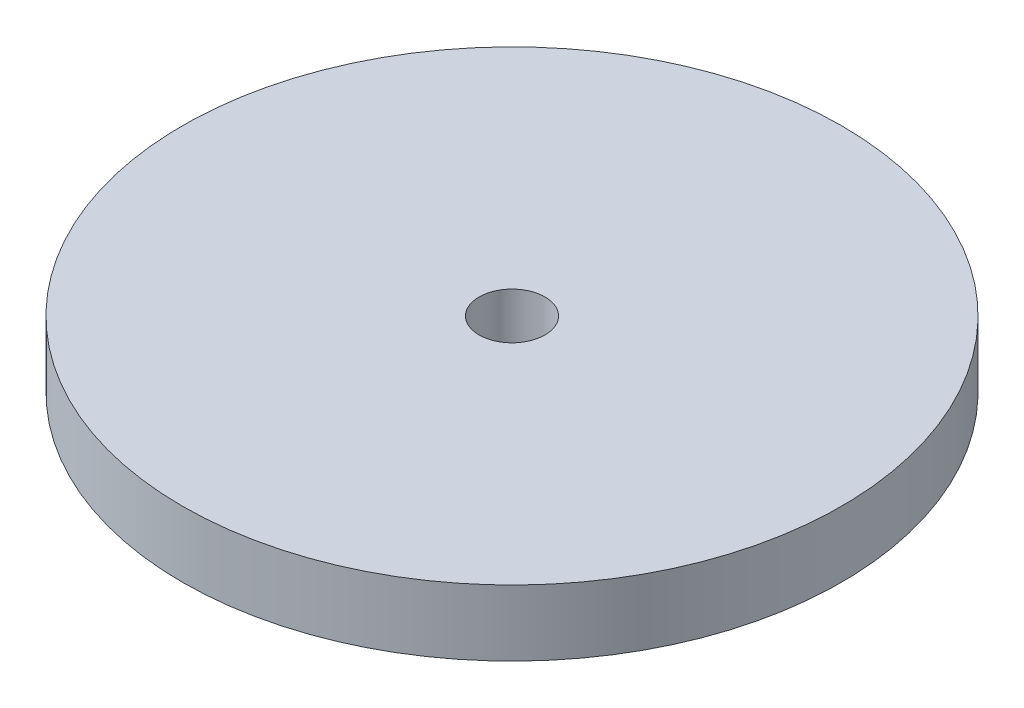
ISO-10303-21;
HEADER;
FILE_DESCRIPTION(('STEP AP214'),'2;1');
FILE_NAME('part.step','',(''),(''),'','','');
FILE_SCHEMA(('AUTOMOTIVE_DESIGN { 1 0 10303 214 1 1 1 1 }'));
ENDSEC;
DATA;
#1=APPLICATION_CONTEXT('core data for automotive mechanical design processes');
#2=APPLICATION_PROTOCOL_DEFINITION('international standard','automotive_design',2000,#1);
#3=PRODUCT_CONTEXT('',#1,'mechanical');
#4=PRODUCT('Part','Part','',(#3));
#5=PRODUCT_RELATED_PRODUCT_CATEGORY('part','',(#4));
#6=PRODUCT_DEFINITION_FORMATION('','',#4);
#7=PRODUCT_DEFINITION_CONTEXT('part definition',#1,'design');
#8=PRODUCT_DEFINITION('design','',#6,#7);
#9=PRODUCT_DEFINITION_SHAPE('','',#8);
#10=(LENGTH_UNIT() NAMED_UNIT(*) SI_UNIT(.MILLI.,.METRE.));
#11=(NAMED_UNIT(*) PLANE_ANGLE_UNIT() SI_UNIT($,.RADIAN.));
#12=(NAMED_UNIT(*) SI_UNIT($,.STERADIAN.) SOLID_ANGLE_UNIT());
#13=UNCERTAINTY_MEASURE_WITH_UNIT(LENGTH_MEASURE(1.E-05),#10,'distance_accuracy_value','');
#14=(GEOMETRIC_REPRESENTATION_CONTEXT(3) GLOBAL_UNCERTAINTY_ASSIGNED_CONTEXT((#13)) GLOBAL_UNIT_ASSIGNED_CONTEXT((#10,
#11,#12)) REPRESENTATION_CONTEXT('',''));
#15=CARTESIAN_POINT('',(0.,0.,0.));
#16=DIRECTION('',(0.,0.,1.));
#17=DIRECTION('',(1.,0.,0.));
#18=AXIS2_PLACEMENT_3D('',#15,#16,#17);
#19=CARTESIAN_POINT('',(0.,10.,0.));
#20=DIRECTION('',(0.,1.,0.));
#21=DIRECTION('',(0.,0.,1.));
#22=AXIS2_PLACEMENT_3D('',#19,#20,#21);
#23=PLANE('',#22);
#24=CARTESIAN_POINT('',(0.,10.,0.));
#25=DIRECTION('',(0.,1.,0.));
#26=DIRECTION('',(0.,0.,1.));
#27=AXIS2_PLACEMENT_3D('',#24,#25,#26);
#28=CIRCLE('',#27,50.);
#29=CARTESIAN_POINT('',(0.,10.,50.));
#30=VERTEX_POINT('',#29);
#31=EDGE_CURVE('E10',#30,#30,#28,.T.);
#32=ORIENTED_EDGE('',*,*,#31,.T.);
#33=EDGE_LOOP('',(#32));
#34=FACE_BOUND('',#33,.T.);
#35=CARTESIAN_POINT('',(0.,10.,0.));
#36=DIRECTION('',(0.,1.,0.));
#37=DIRECTION('',(0.,0.,1.));
#38=AXIS2_PLACEMENT_3D('',#35,#36,#37);
#39=CIRCLE('',#38,5.);
#40=CARTESIAN_POINT('',(0.,10.,5.));
#41=VERTEX_POINT('',#40);
#42=EDGE_CURVE('E46',#41,#41,#39,.T.);
#43=ORIENTED_EDGE('',*,*,#42,.F.);
#44=EDGE_LOOP('',(#43));
#45=FACE_BOUND('',#44,.T.);
#46=ADVANCED_FACE('F35',(#34,#45),#23,.T.);
#47=CARTESIAN_POINT('',(0.,0.,0.));
#48=DIRECTION('',(0.,1.,0.));
#49=DIRECTION('',(0.,0.,1.));
#50=AXIS2_PLACEMENT_3D('',#47,#48,#49);
#51=PLANE('',#50);
#52=CARTESIAN_POINT('',(0.,0.,0.));
#53=DIRECTION('',(0.,1.,0.));
#54=DIRECTION('',(0.,0.,1.));
#55=AXIS2_PLACEMENT_3D('',#52,#53,#54);
#56=CIRCLE('',#55,50.);
#57=CARTESIAN_POINT('',(0.,0.,50.));
#58=VERTEX_POINT('',#57);
#59=EDGE_CURVE('E39',#58,#58,#56,.T.);
#60=ORIENTED_EDGE('',*,*,#59,.F.);
#61=EDGE_LOOP('',(#60));
#62=FACE_BOUND('',#61,.T.);
#63=CARTESIAN_POINT('',(0.,0.,0.));
#64=DIRECTION('',(0.,1.,0.));
#65=DIRECTION('',(0.,0.,1.));
#66=AXIS2_PLACEMENT_3D('',#63,#64,#65);
#67=CIRCLE('',#66,5.);
#68=CARTESIAN_POINT('',(0.,0.,5.));
#69=VERTEX_POINT('',#68);
#70=EDGE_CURVE('E48',#69,#69,#67,.T.);
#71=ORIENTED_EDGE('',*,*,#70,.T.);
#72=EDGE_LOOP('',(#71));
#73=FACE_BOUND('',#72,.T.);
#74=ADVANCED_FACE('F58',(#62,#73),#51,.F.);
#75=CARTESIAN_POINT('',(0.,10.,0.));
#76=DIRECTION('',(0.,-1.,0.));
#77=DIRECTION('',(0.,0.,-1.));
#78=AXIS2_PLACEMENT_3D('',#75,#76,#77);
#79=CYLINDRICAL_SURFACE('',#78,50.);
#80=ORIENTED_EDGE('',*,*,#31,.F.);
#81=EDGE_LOOP('',(#80));
#82=FACE_BOUND('',#81,.T.);
#83=ORIENTED_EDGE('',*,*,#59,.T.);
#84=EDGE_LOOP('',(#83));
#85=FACE_BOUND('',#84,.T.);
#86=ADVANCED_FACE('F37',(#82,#85),#79,.T.);
#87=CARTESIAN_POINT('',(0.,10.,0.));
#88=DIRECTION('',(0.,-1.,0.));
#89=DIRECTION('',(0.,0.,-1.));
#90=AXIS2_PLACEMENT_3D('',#87,#88,#89);
#91=CYLINDRICAL_SURFACE('',#90,5.);
#92=ORIENTED_EDGE('',*,*,#42,.T.);
#93=EDGE_LOOP('',(#92));
#94=FACE_BOUND('',#93,.T.);
#95=ORIENTED_EDGE('',*,*,#70,.F.);
#96=EDGE_LOOP('',(#95));
#97=FACE_BOUND('',#96,.T.);
#98=ADVANCED_FACE('F54',(#94,#97),#91,.F.);
#99=CLOSED_SHELL('',(#46,#74,#86,#98));
#100=MANIFOLD_SOLID_BREP('B2',#99);
#101=ADVANCED_BREP_SHAPE_REPRESENTATION('',(#18,#100),#14);
#102=SHAPE_DEFINITION_REPRESENTATION(#9,#101);
ENDSEC;
END-ISO-10303-21;
